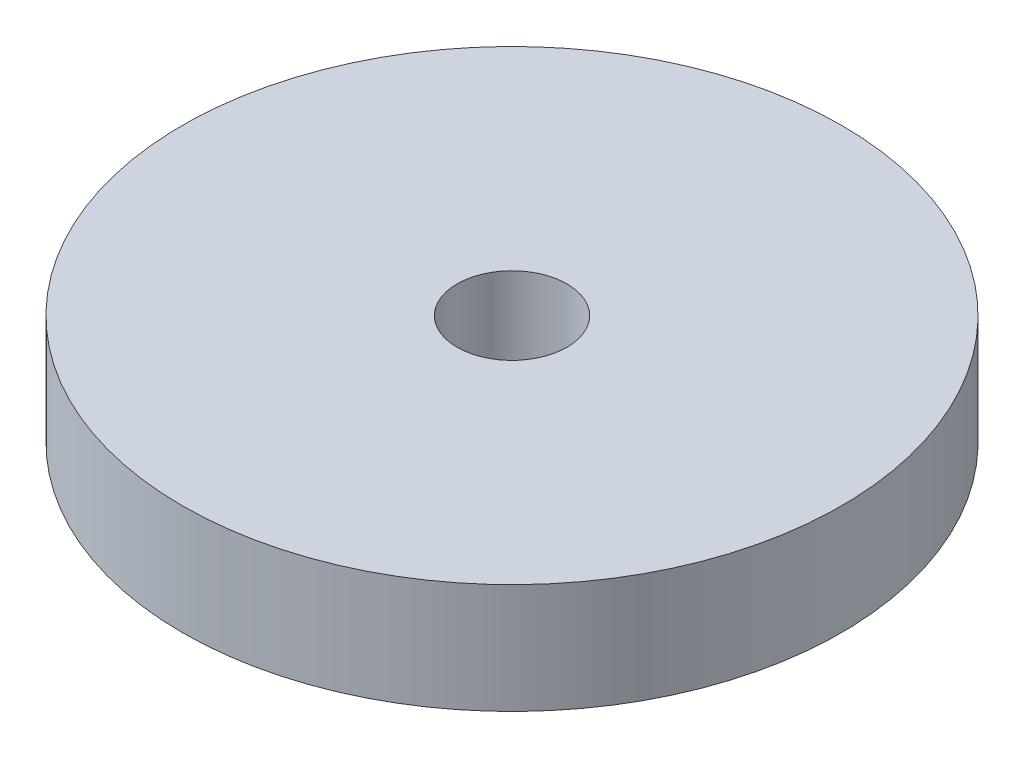
ISO-10303-21;
HEADER;
FILE_DESCRIPTION(('STEP AP214'),'2;1');
FILE_NAME('part.step','',(''),(''),'','','');
FILE_SCHEMA(('AUTOMOTIVE_DESIGN { 1 0 10303 214 1 1 1 1 }'));
ENDSEC;
DATA;
#1=APPLICATION_CONTEXT('core data for automotive mechanical design processes');
#2=APPLICATION_PROTOCOL_DEFINITION('international standard','automotive_design',2000,#1);
#3=PRODUCT_CONTEXT('',#1,'mechanical');
#4=PRODUCT('Part','Part','',(#3));
#5=PRODUCT_RELATED_PRODUCT_CATEGORY('part','',(#4));
#6=PRODUCT_DEFINITION_FORMATION('','',#4);
#7=PRODUCT_DEFINITION_CONTEXT('part definition',#1,'design');
#8=PRODUCT_DEFINITION('design','',#6,#7);
#9=PRODUCT_DEFINITION_SHAPE('','',#8);
#10=(LENGTH_UNIT() NAMED_UNIT(*) SI_UNIT(.MILLI.,.METRE.));
#11=(NAMED_UNIT(*) PLANE_ANGLE_UNIT() SI_UNIT($,.RADIAN.));
#12=(NAMED_UNIT(*) SI_UNIT($,.STERADIAN.) SOLID_ANGLE_UNIT());
#13=UNCERTAINTY_MEASURE_WITH_UNIT(LENGTH_MEASURE(1.E-05),#10,'distance_accuracy_value','');
#14=(GEOMETRIC_REPRESENTATION_CONTEXT(3) GLOBAL_UNCERTAINTY_ASSIGNED_CONTEXT((#13)) GLOBAL_UNIT_ASSIGNED_CONTEXT((#10,
#11,#12)) REPRESENTATION_CONTEXT('',''));
#15=CARTESIAN_POINT('',(0.,0.,0.));
#16=DIRECTION('',(0.,0.,1.));
#17=DIRECTION('',(1.,0.,0.));
#18=AXIS2_PLACEMENT_3D('',#15,#16,#17);
#19=CARTESIAN_POINT('',(0.,3.175,0.));
#20=DIRECTION('',(0.,1.,0.));
#21=DIRECTION('',(0.,0.,1.));
#22=AXIS2_PLACEMENT_3D('',#19,#20,#21);
#23=PLANE('',#22);
#24=CARTESIAN_POINT('',(0.,3.175,0.));
#25=DIRECTION('',(0.,1.,0.));
#26=DIRECTION('',(0.,0.,1.));
#27=AXIS2_PLACEMENT_3D('',#24,#25,#26);
#28=CIRCLE('',#27,9.525);
#29=CARTESIAN_POINT('',(0.,3.175,9.525));
#30=VERTEX_POINT('',#29);
#31=EDGE_CURVE('E10',#30,#30,#28,.T.);
#32=ORIENTED_EDGE('',*,*,#31,.T.);
#33=EDGE_LOOP('',(#32));
#34=FACE_BOUND('',#33,.T.);
#35=CARTESIAN_POINT('',(0.,3.175,0.));
#36=DIRECTION('',(0.,1.,0.));
#37=DIRECTION('',(0.,0.,1.));
#38=AXIS2_PLACEMENT_3D('',#35,#36,#37);
#39=CIRCLE('',#38,1.5875);
#40=CARTESIAN_POINT('',(0.,3.175,1.5875));
#41=VERTEX_POINT('',#40);
#42=EDGE_CURVE('E42',#41,#41,#39,.T.);
#43=ORIENTED_EDGE('',*,*,#42,.F.);
#44=EDGE_LOOP('',(#43));
#45=FACE_BOUND('',#44,.T.);
#46=ADVANCED_FACE('F31',(#34,#45),#23,.T.);
#47=CARTESIAN_POINT('',(0.,0.,0.));
#48=DIRECTION('',(0.,1.,0.));
#49=DIRECTION('',(0.,0.,1.));
#50=AXIS2_PLACEMENT_3D('',#47,#48,#49);
#51=PLANE('',#50);
#52=CARTESIAN_POINT('',(0.,0.,0.));
#53=DIRECTION('',(0.,1.,0.));
#54=DIRECTION('',(0.,0.,1.));
#55=AXIS2_PLACEMENT_3D('',#52,#53,#54);
#56=CIRCLE('',#55,9.525);
#57=CARTESIAN_POINT('',(0.,0.,9.525));
#58=VERTEX_POINT('',#57);
#59=EDGE_CURVE('E35',#58,#58,#56,.T.);
#60=ORIENTED_EDGE('',*,*,#59,.F.);
#61=EDGE_LOOP('',(#60));
#62=FACE_BOUND('',#61,.T.);
#63=CARTESIAN_POINT('',(0.,0.,0.));
#64=DIRECTION('',(0.,1.,0.));
#65=DIRECTION('',(0.,0.,1.));
#66=AXIS2_PLACEMENT_3D('',#63,#64,#65);
#67=CIRCLE('',#66,1.5875);
#68=CARTESIAN_POINT('',(0.,0.,1.5875));
#69=VERTEX_POINT('',#68);
#70=EDGE_CURVE('E44',#69,#69,#67,.T.);
#71=ORIENTED_EDGE('',*,*,#70,.T.);
#72=EDGE_LOOP('',(#71));
#73=FACE_BOUND('',#72,.T.);
#74=ADVANCED_FACE('F54',(#62,#73),#51,.F.);
#75=CARTESIAN_POINT('',(0.,3.175,0.));
#76=DIRECTION('',(0.,-1.,0.));
#77=DIRECTION('',(0.,0.,-1.));
#78=AXIS2_PLACEMENT_3D('',#75,#76,#77);
#79=CYLINDRICAL_SURFACE('',#78,9.525);
#80=ORIENTED_EDGE('',*,*,#31,.F.);
#81=EDGE_LOOP('',(#80));
#82=FACE_BOUND('',#81,.T.);
#83=ORIENTED_EDGE('',*,*,#59,.T.);
#84=EDGE_LOOP('',(#83));
#85=FACE_BOUND('',#84,.T.);
#86=ADVANCED_FACE('F33',(#82,#85),#79,.T.);
#87=CARTESIAN_POINT('',(0.,3.175,0.));
#88=DIRECTION('',(0.,-1.,0.));
#89=DIRECTION('',(0.,0.,-1.));
#90=AXIS2_PLACEMENT_3D('',#87,#88,#89);
#91=CYLINDRICAL_SURFACE('',#90,1.5875);
#92=ORIENTED_EDGE('',*,*,#42,.T.);
#93=EDGE_LOOP('',(#92));
#94=FACE_BOUND('',#93,.T.);
#95=ORIENTED_EDGE('',*,*,#70,.F.);
#96=EDGE_LOOP('',(#95));
#97=FACE_BOUND('',#96,.T.);
#98=ADVANCED_FACE('F50',(#94,#97),#91,.F.);
#99=CLOSED_SHELL('',(#46,#74,#86,#98));
#100=MANIFOLD_SOLID_BREP('B2',#99);
#101=ADVANCED_BREP_SHAPE_REPRESENTATION('',(#18,#100),#14);
#102=SHAPE_DEFINITION_REPRESENTATION(#9,#101);
ENDSEC;
END-ISO-10303-21;
